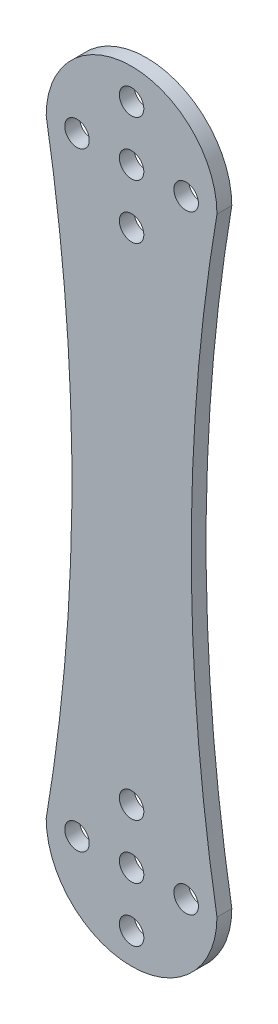
ISO-10303-21;
HEADER;
FILE_DESCRIPTION(('STEP AP214'),'2;1');
FILE_NAME('part.step','',(''),(''),'','','');
FILE_SCHEMA(('AUTOMOTIVE_DESIGN { 1 0 10303 214 1 1 1 1 }'));
ENDSEC;
DATA;
#1=APPLICATION_CONTEXT('core data for automotive mechanical design processes');
#2=APPLICATION_PROTOCOL_DEFINITION('international standard','automotive_design',2000,#1);
#3=PRODUCT_CONTEXT('',#1,'mechanical');
#4=PRODUCT('Part','Part','',(#3));
#5=PRODUCT_RELATED_PRODUCT_CATEGORY('part','',(#4));
#6=PRODUCT_DEFINITION_FORMATION('','',#4);
#7=PRODUCT_DEFINITION_CONTEXT('part definition',#1,'design');
#8=PRODUCT_DEFINITION('design','',#6,#7);
#9=PRODUCT_DEFINITION_SHAPE('','',#8);
#10=(LENGTH_UNIT() NAMED_UNIT(*) SI_UNIT(.MILLI.,.METRE.));
#11=(NAMED_UNIT(*) PLANE_ANGLE_UNIT() SI_UNIT($,.RADIAN.));
#12=(NAMED_UNIT(*) SI_UNIT($,.STERADIAN.) SOLID_ANGLE_UNIT());
#13=UNCERTAINTY_MEASURE_WITH_UNIT(LENGTH_MEASURE(1.E-05),#10,'distance_accuracy_value','');
#14=(GEOMETRIC_REPRESENTATION_CONTEXT(3) GLOBAL_UNCERTAINTY_ASSIGNED_CONTEXT((#13)) GLOBAL_UNIT_ASSIGNED_CONTEXT((#10,
#11,#12)) REPRESENTATION_CONTEXT('',''));
#15=CARTESIAN_POINT('',(0.,0.,0.));
#16=DIRECTION('',(0.,0.,1.));
#17=DIRECTION('',(1.,0.,0.));
#18=AXIS2_PLACEMENT_3D('',#15,#16,#17);
#19=CARTESIAN_POINT('',(305.86953285522,-29.3815576891017,2.));
#20=DIRECTION('',(0.,0.,-1.));
#21=DIRECTION('',(-1.,0.,0.));
#22=AXIS2_PLACEMENT_3D('',#19,#20,#21);
#23=CYLINDRICAL_SURFACE('',#22,244.402453237297);
#24=CARTESIAN_POINT('',(305.86953285522,-29.3815576891017,0.));
#25=DIRECTION('',(0.,0.,1.));
#26=DIRECTION('',(1.,0.,0.));
#27=AXIS2_PLACEMENT_3D('',#24,#25,#26);
#28=CIRCLE('',#27,244.402453237297);
#29=CARTESIAN_POINT('',(64.9306212024747,11.6184423108982,0.));
#30=VERTEX_POINT('',#29);
#31=CARTESIAN_POINT('',(64.9306212024748,-70.3815576891018,0.));
#32=VERTEX_POINT('',#31);
#33=EDGE_CURVE('E128',#30,#32,#28,.T.);
#34=ORIENTED_EDGE('',*,*,#33,.F.);
#35=DIRECTION('',(0.,0.,-1.));
#36=VECTOR('',#35,1.);
#37=CARTESIAN_POINT('',(64.9306212024747,11.6184423108982,2.));
#38=LINE('',#37,#36);
#39=CARTESIAN_POINT('',(64.9306212024747,11.6184423108982,2.));
#40=VERTEX_POINT('',#39);
#41=EDGE_CURVE('E11',#40,#30,#38,.T.);
#42=ORIENTED_EDGE('',*,*,#41,.F.);
#43=CARTESIAN_POINT('',(305.86953285522,-29.3815576891017,2.));
#44=DIRECTION('',(0.,0.,1.));
#45=DIRECTION('',(1.,0.,0.));
#46=AXIS2_PLACEMENT_3D('',#43,#44,#45);
#47=CIRCLE('',#46,244.402453237297);
#48=CARTESIAN_POINT('',(64.9306212024748,-70.3815576891018,2.));
#49=VERTEX_POINT('',#48);
#50=EDGE_CURVE('E83',#40,#49,#47,.T.);
#51=ORIENTED_EDGE('',*,*,#50,.T.);
#52=DIRECTION('',(0.,0.,-1.));
#53=VECTOR('',#52,1.);
#54=CARTESIAN_POINT('',(64.9306212024748,-70.3815576891018,2.));
#55=LINE('',#54,#53);
#56=EDGE_CURVE('E50',#49,#32,#55,.T.);
#57=ORIENTED_EDGE('',*,*,#56,.T.);
#58=EDGE_LOOP('',(#34,#42,#51,#57));
#59=FACE_BOUND('',#58,.T.);
#60=ADVANCED_FACE('F34',(#59),#23,.F.);
#61=CARTESIAN_POINT('',(53.4306212024747,11.6184423108982,2.));
#62=DIRECTION('',(0.,0.,-1.));
#63=DIRECTION('',(-1.,0.,0.));
#64=AXIS2_PLACEMENT_3D('',#61,#62,#63);
#65=CYLINDRICAL_SURFACE('',#64,11.5);
#66=CARTESIAN_POINT('',(53.4306212024747,11.6184423108982,0.));
#67=DIRECTION('',(0.,0.,1.));
#68=DIRECTION('',(1.,0.,0.));
#69=AXIS2_PLACEMENT_3D('',#66,#67,#68);
#70=CIRCLE('',#69,11.5);
#71=CARTESIAN_POINT('',(41.9306212024747,11.6184423108982,0.));
#72=VERTEX_POINT('',#71);
#73=EDGE_CURVE('E89',#30,#72,#70,.T.);
#74=ORIENTED_EDGE('',*,*,#73,.T.);
#75=DIRECTION('',(0.,0.,-1.));
#76=VECTOR('',#75,1.);
#77=CARTESIAN_POINT('',(41.9306212024747,11.6184423108982,2.));
#78=LINE('',#77,#76);
#79=CARTESIAN_POINT('',(41.9306212024747,11.6184423108982,2.));
#80=VERTEX_POINT('',#79);
#81=EDGE_CURVE('E42',#80,#72,#78,.T.);
#82=ORIENTED_EDGE('',*,*,#81,.F.);
#83=CARTESIAN_POINT('',(53.4306212024747,11.6184423108982,2.));
#84=DIRECTION('',(0.,0.,1.));
#85=DIRECTION('',(1.,0.,0.));
#86=AXIS2_PLACEMENT_3D('',#83,#84,#85);
#87=CIRCLE('',#86,11.5);
#88=EDGE_CURVE('E76',#40,#80,#87,.T.);
#89=ORIENTED_EDGE('',*,*,#88,.F.);
#90=ORIENTED_EDGE('',*,*,#41,.T.);
#91=EDGE_LOOP('',(#74,#82,#89,#90));
#92=FACE_BOUND('',#91,.T.);
#93=ADVANCED_FACE('F87',(#92),#65,.T.);
#94=CARTESIAN_POINT('',(-199.00829045027,-29.3815576891018,2.));
#95=DIRECTION('',(0.,0.,-1.));
#96=DIRECTION('',(-1.,0.,0.));
#97=AXIS2_PLACEMENT_3D('',#94,#95,#96);
#98=CYLINDRICAL_SURFACE('',#97,244.402453237297);
#99=CARTESIAN_POINT('',(-199.00829045027,-29.3815576891018,0.));
#100=DIRECTION('',(0.,0.,1.));
#101=DIRECTION('',(1.,0.,0.));
#102=AXIS2_PLACEMENT_3D('',#99,#100,#101);
#103=CIRCLE('',#102,244.402453237297);
#104=CARTESIAN_POINT('',(41.9306212024748,-70.3815576891018,0.));
#105=VERTEX_POINT('',#104);
#106=EDGE_CURVE('E131',#72,#105,#103,.F.);
#107=ORIENTED_EDGE('',*,*,#106,.T.);
#108=DIRECTION('',(0.,0.,-1.));
#109=VECTOR('',#108,1.);
#110=CARTESIAN_POINT('',(41.9306212024748,-70.3815576891018,2.));
#111=LINE('',#110,#109);
#112=CARTESIAN_POINT('',(41.9306212024748,-70.3815576891018,2.));
#113=VERTEX_POINT('',#112);
#114=EDGE_CURVE('E64',#113,#105,#111,.T.);
#115=ORIENTED_EDGE('',*,*,#114,.F.);
#116=CARTESIAN_POINT('',(-199.00829045027,-29.3815576891018,2.));
#117=DIRECTION('',(0.,0.,1.));
#118=DIRECTION('',(1.,0.,0.));
#119=AXIS2_PLACEMENT_3D('',#116,#117,#118);
#120=CIRCLE('',#119,244.402453237297);
#121=EDGE_CURVE('E82',#80,#113,#120,.F.);
#122=ORIENTED_EDGE('',*,*,#121,.F.);
#123=ORIENTED_EDGE('',*,*,#81,.T.);
#124=EDGE_LOOP('',(#107,#115,#122,#123));
#125=FACE_BOUND('',#124,.T.);
#126=ADVANCED_FACE('F92',(#125),#98,.F.);
#127=CARTESIAN_POINT('',(60.7806212024748,-70.3815576891018,2.));
#128=DIRECTION('',(0.,0.,-1.));
#129=DIRECTION('',(-1.,0.,0.));
#130=AXIS2_PLACEMENT_3D('',#127,#128,#129);
#131=CYLINDRICAL_SURFACE('',#130,1.65);
#132=CARTESIAN_POINT('',(60.7806212024748,-70.3815576891018,2.));
#133=DIRECTION('',(0.,0.,1.));
#134=DIRECTION('',(1.,0.,0.));
#135=AXIS2_PLACEMENT_3D('',#132,#133,#134);
#136=CIRCLE('',#135,1.65);
#137=CARTESIAN_POINT('',(62.4306212024748,-70.3815576891018,2.));
#138=VERTEX_POINT('',#137);
#139=EDGE_CURVE('E122',#138,#138,#136,.T.);
#140=ORIENTED_EDGE('',*,*,#139,.T.);
#141=EDGE_LOOP('',(#140));
#142=FACE_BOUND('',#141,.T.);
#143=CARTESIAN_POINT('',(60.7806212024748,-70.3815576891018,0.));
#144=DIRECTION('',(0.,0.,1.));
#145=DIRECTION('',(1.,0.,0.));
#146=AXIS2_PLACEMENT_3D('',#143,#144,#145);
#147=CIRCLE('',#146,1.65);
#148=CARTESIAN_POINT('',(62.4306212024748,-70.3815576891018,0.));
#149=VERTEX_POINT('',#148);
#150=EDGE_CURVE('E160',#149,#149,#147,.T.);
#151=ORIENTED_EDGE('',*,*,#150,.F.);
#152=EDGE_LOOP('',(#151));
#153=FACE_BOUND('',#152,.T.);
#154=ADVANCED_FACE('F191',(#142,#153),#131,.F.);
#155=CARTESIAN_POINT('',(53.4306212024748,-63.0315576891018,2.));
#156=DIRECTION('',(0.,0.,-1.));
#157=DIRECTION('',(-1.,0.,0.));
#158=AXIS2_PLACEMENT_3D('',#155,#156,#157);
#159=CYLINDRICAL_SURFACE('',#158,1.65);
#160=CARTESIAN_POINT('',(53.4306212024748,-63.0315576891018,2.));
#161=DIRECTION('',(0.,0.,1.));
#162=DIRECTION('',(1.,0.,0.));
#163=AXIS2_PLACEMENT_3D('',#160,#161,#162);
#164=CIRCLE('',#163,1.65);
#165=CARTESIAN_POINT('',(55.0806212024748,-63.0315576891018,2.));
#166=VERTEX_POINT('',#165);
#167=EDGE_CURVE('E119',#166,#166,#164,.T.);
#168=ORIENTED_EDGE('',*,*,#167,.T.);
#169=EDGE_LOOP('',(#168));
#170=FACE_BOUND('',#169,.T.);
#171=CARTESIAN_POINT('',(53.4306212024748,-63.0315576891018,0.));
#172=DIRECTION('',(0.,0.,1.));
#173=DIRECTION('',(1.,0.,0.));
#174=AXIS2_PLACEMENT_3D('',#171,#172,#173);
#175=CIRCLE('',#174,1.65);
#176=CARTESIAN_POINT('',(55.0806212024748,-63.0315576891018,0.));
#177=VERTEX_POINT('',#176);
#178=EDGE_CURVE('E157',#177,#177,#175,.T.);
#179=ORIENTED_EDGE('',*,*,#178,.F.);
#180=EDGE_LOOP('',(#179));
#181=FACE_BOUND('',#180,.T.);
#182=ADVANCED_FACE('F195',(#170,#181),#159,.F.);
#183=CARTESIAN_POINT('',(53.4306212024748,-70.3815576891018,2.));
#184=DIRECTION('',(0.,0.,-1.));
#185=DIRECTION('',(-1.,0.,0.));
#186=AXIS2_PLACEMENT_3D('',#183,#184,#185);
#187=CYLINDRICAL_SURFACE('',#186,1.65);
#188=CARTESIAN_POINT('',(53.4306212024748,-70.3815576891018,2.));
#189=DIRECTION('',(0.,0.,1.));
#190=DIRECTION('',(1.,0.,0.));
#191=AXIS2_PLACEMENT_3D('',#188,#189,#190);
#192=CIRCLE('',#191,1.65);
#193=CARTESIAN_POINT('',(55.0806212024748,-70.3815576891018,2.));
#194=VERTEX_POINT('',#193);
#195=EDGE_CURVE('E116',#194,#194,#192,.F.);
#196=ORIENTED_EDGE('',*,*,#195,.F.);
#197=EDGE_LOOP('',(#196));
#198=FACE_BOUND('',#197,.T.);
#199=CARTESIAN_POINT('',(53.4306212024748,-70.3815576891018,0.));
#200=DIRECTION('',(0.,0.,1.));
#201=DIRECTION('',(1.,0.,0.));
#202=AXIS2_PLACEMENT_3D('',#199,#200,#201);
#203=CIRCLE('',#202,1.65);
#204=CARTESIAN_POINT('',(55.0806212024748,-70.3815576891018,0.));
#205=VERTEX_POINT('',#204);
#206=EDGE_CURVE('E154',#205,#205,#203,.F.);
#207=ORIENTED_EDGE('',*,*,#206,.T.);
#208=EDGE_LOOP('',(#207));
#209=FACE_BOUND('',#208,.T.);
#210=ADVANCED_FACE('F201',(#198,#209),#187,.F.);
#211=CARTESIAN_POINT('',(60.7806212024747,11.6184423108982,2.));
#212=DIRECTION('',(0.,0.,-1.));
#213=DIRECTION('',(-1.,0.,0.));
#214=AXIS2_PLACEMENT_3D('',#211,#212,#213);
#215=CYLINDRICAL_SURFACE('',#214,1.65);
#216=CARTESIAN_POINT('',(60.7806212024747,11.6184423108982,2.));
#217=DIRECTION('',(0.,0.,1.));
#218=DIRECTION('',(1.,0.,0.));
#219=AXIS2_PLACEMENT_3D('',#216,#217,#218);
#220=CIRCLE('',#219,1.65);
#221=CARTESIAN_POINT('',(62.4306212024747,11.6184423108982,2.));
#222=VERTEX_POINT('',#221);
#223=EDGE_CURVE('E113',#222,#222,#220,.F.);
#224=ORIENTED_EDGE('',*,*,#223,.F.);
#225=EDGE_LOOP('',(#224));
#226=FACE_BOUND('',#225,.T.);
#227=CARTESIAN_POINT('',(60.7806212024747,11.6184423108982,0.));
#228=DIRECTION('',(0.,0.,1.));
#229=DIRECTION('',(1.,0.,0.));
#230=AXIS2_PLACEMENT_3D('',#227,#228,#229);
#231=CIRCLE('',#230,1.65);
#232=CARTESIAN_POINT('',(62.4306212024747,11.6184423108982,0.));
#233=VERTEX_POINT('',#232);
#234=EDGE_CURVE('E151',#233,#233,#231,.F.);
#235=ORIENTED_EDGE('',*,*,#234,.T.);
#236=EDGE_LOOP('',(#235));
#237=FACE_BOUND('',#236,.T.);
#238=ADVANCED_FACE('F209',(#226,#237),#215,.F.);
#239=CARTESIAN_POINT('',(53.4306212024748,18.9684423108982,2.));
#240=DIRECTION('',(0.,0.,-1.));
#241=DIRECTION('',(-1.,0.,0.));
#242=AXIS2_PLACEMENT_3D('',#239,#240,#241);
#243=CYLINDRICAL_SURFACE('',#242,1.64999999999999);
#244=CARTESIAN_POINT('',(53.4306212024748,18.9684423108982,2.));
#245=DIRECTION('',(0.,0.,1.));
#246=DIRECTION('',(1.,0.,0.));
#247=AXIS2_PLACEMENT_3D('',#244,#245,#246);
#248=CIRCLE('',#247,1.64999999999999);
#249=CARTESIAN_POINT('',(55.0806212024748,18.9684423108982,2.));
#250=VERTEX_POINT('',#249);
#251=EDGE_CURVE('E110',#250,#250,#248,.T.);
#252=ORIENTED_EDGE('',*,*,#251,.T.);
#253=EDGE_LOOP('',(#252));
#254=FACE_BOUND('',#253,.T.);
#255=CARTESIAN_POINT('',(53.4306212024748,18.9684423108982,0.));
#256=DIRECTION('',(0.,0.,1.));
#257=DIRECTION('',(1.,0.,0.));
#258=AXIS2_PLACEMENT_3D('',#255,#256,#257);
#259=CIRCLE('',#258,1.64999999999999);
#260=CARTESIAN_POINT('',(55.0806212024748,18.9684423108982,0.));
#261=VERTEX_POINT('',#260);
#262=EDGE_CURVE('E148',#261,#261,#259,.T.);
#263=ORIENTED_EDGE('',*,*,#262,.F.);
#264=EDGE_LOOP('',(#263));
#265=FACE_BOUND('',#264,.T.);
#266=ADVANCED_FACE('F213',(#254,#265),#243,.F.);
#267=CARTESIAN_POINT('',(46.0806212024747,11.6184423108982,2.));
#268=DIRECTION('',(0.,0.,-1.));
#269=DIRECTION('',(-1.,0.,0.));
#270=AXIS2_PLACEMENT_3D('',#267,#268,#269);
#271=CYLINDRICAL_SURFACE('',#270,1.65);
#272=CARTESIAN_POINT('',(46.0806212024747,11.6184423108982,2.));
#273=DIRECTION('',(0.,0.,1.));
#274=DIRECTION('',(1.,0.,0.));
#275=AXIS2_PLACEMENT_3D('',#272,#273,#274);
#276=CIRCLE('',#275,1.65);
#277=CARTESIAN_POINT('',(47.7306212024747,11.6184423108982,2.));
#278=VERTEX_POINT('',#277);
#279=EDGE_CURVE('E107',#278,#278,#276,.T.);
#280=ORIENTED_EDGE('',*,*,#279,.T.);
#281=EDGE_LOOP('',(#280));
#282=FACE_BOUND('',#281,.T.);
#283=CARTESIAN_POINT('',(46.0806212024747,11.6184423108982,0.));
#284=DIRECTION('',(0.,0.,1.));
#285=DIRECTION('',(1.,0.,0.));
#286=AXIS2_PLACEMENT_3D('',#283,#284,#285);
#287=CIRCLE('',#286,1.65);
#288=CARTESIAN_POINT('',(47.7306212024747,11.6184423108982,0.));
#289=VERTEX_POINT('',#288);
#290=EDGE_CURVE('E145',#289,#289,#287,.T.);
#291=ORIENTED_EDGE('',*,*,#290,.F.);
#292=EDGE_LOOP('',(#291));
#293=FACE_BOUND('',#292,.T.);
#294=ADVANCED_FACE('F217',(#282,#293),#271,.F.);
#295=CARTESIAN_POINT('',(53.4306212024747,11.6184423108982,2.));
#296=DIRECTION('',(0.,0.,-1.));
#297=DIRECTION('',(-1.,0.,0.));
#298=AXIS2_PLACEMENT_3D('',#295,#296,#297);
#299=CYLINDRICAL_SURFACE('',#298,1.65);
#300=CARTESIAN_POINT('',(53.4306212024747,11.6184423108982,2.));
#301=DIRECTION('',(0.,0.,1.));
#302=DIRECTION('',(1.,0.,0.));
#303=AXIS2_PLACEMENT_3D('',#300,#301,#302);
#304=CIRCLE('',#303,1.65);
#305=CARTESIAN_POINT('',(55.0806212024747,11.6184423108982,2.));
#306=VERTEX_POINT('',#305);
#307=EDGE_CURVE('E104',#306,#306,#304,.T.);
#308=ORIENTED_EDGE('',*,*,#307,.T.);
#309=EDGE_LOOP('',(#308));
#310=FACE_BOUND('',#309,.T.);
#311=CARTESIAN_POINT('',(53.4306212024747,11.6184423108982,0.));
#312=DIRECTION('',(0.,0.,1.));
#313=DIRECTION('',(1.,0.,0.));
#314=AXIS2_PLACEMENT_3D('',#311,#312,#313);
#315=CIRCLE('',#314,1.65);
#316=CARTESIAN_POINT('',(55.0806212024747,11.6184423108982,0.));
#317=VERTEX_POINT('',#316);
#318=EDGE_CURVE('E142',#317,#317,#315,.T.);
#319=ORIENTED_EDGE('',*,*,#318,.F.);
#320=EDGE_LOOP('',(#319));
#321=FACE_BOUND('',#320,.T.);
#322=ADVANCED_FACE('F221',(#310,#321),#299,.F.);
#323=CARTESIAN_POINT('',(53.4306212024747,4.26844231089819,2.));
#324=DIRECTION('',(0.,0.,-1.));
#325=DIRECTION('',(-1.,0.,0.));
#326=AXIS2_PLACEMENT_3D('',#323,#324,#325);
#327=CYLINDRICAL_SURFACE('',#326,1.65);
#328=CARTESIAN_POINT('',(53.4306212024747,4.26844231089819,2.));
#329=DIRECTION('',(0.,0.,1.));
#330=DIRECTION('',(1.,0.,0.));
#331=AXIS2_PLACEMENT_3D('',#328,#329,#330);
#332=CIRCLE('',#331,1.65);
#333=CARTESIAN_POINT('',(55.0806212024747,4.26844231089819,2.));
#334=VERTEX_POINT('',#333);
#335=EDGE_CURVE('E101',#334,#334,#332,.F.);
#336=ORIENTED_EDGE('',*,*,#335,.F.);
#337=EDGE_LOOP('',(#336));
#338=FACE_BOUND('',#337,.T.);
#339=CARTESIAN_POINT('',(53.4306212024747,4.26844231089819,0.));
#340=DIRECTION('',(0.,0.,1.));
#341=DIRECTION('',(1.,0.,0.));
#342=AXIS2_PLACEMENT_3D('',#339,#340,#341);
#343=CIRCLE('',#342,1.65);
#344=CARTESIAN_POINT('',(55.0806212024747,4.26844231089819,0.));
#345=VERTEX_POINT('',#344);
#346=EDGE_CURVE('E139',#345,#345,#343,.F.);
#347=ORIENTED_EDGE('',*,*,#346,.T.);
#348=EDGE_LOOP('',(#347));
#349=FACE_BOUND('',#348,.T.);
#350=ADVANCED_FACE('F180',(#338,#349),#327,.F.);
#351=CARTESIAN_POINT('',(46.0806212024747,-70.3815576891018,2.));
#352=DIRECTION('',(0.,0.,-1.));
#353=DIRECTION('',(-1.,0.,0.));
#354=AXIS2_PLACEMENT_3D('',#351,#352,#353);
#355=CYLINDRICAL_SURFACE('',#354,1.65);
#356=CARTESIAN_POINT('',(46.0806212024747,-70.3815576891018,2.));
#357=DIRECTION('',(0.,0.,1.));
#358=DIRECTION('',(1.,0.,0.));
#359=AXIS2_PLACEMENT_3D('',#356,#357,#358);
#360=CIRCLE('',#359,1.65);
#361=CARTESIAN_POINT('',(47.7306212024747,-70.3815576891018,2.));
#362=VERTEX_POINT('',#361);
#363=EDGE_CURVE('E95',#362,#362,#360,.F.);
#364=ORIENTED_EDGE('',*,*,#363,.F.);
#365=EDGE_LOOP('',(#364));
#366=FACE_BOUND('',#365,.T.);
#367=CARTESIAN_POINT('',(46.0806212024747,-70.3815576891018,0.));
#368=DIRECTION('',(0.,0.,1.));
#369=DIRECTION('',(1.,0.,0.));
#370=AXIS2_PLACEMENT_3D('',#367,#368,#369);
#371=CIRCLE('',#370,1.65);
#372=CARTESIAN_POINT('',(47.7306212024747,-70.3815576891018,0.));
#373=VERTEX_POINT('',#372);
#374=EDGE_CURVE('E136',#373,#373,#371,.F.);
#375=ORIENTED_EDGE('',*,*,#374,.T.);
#376=EDGE_LOOP('',(#375));
#377=FACE_BOUND('',#376,.T.);
#378=ADVANCED_FACE('F172',(#366,#377),#355,.F.);
#379=CARTESIAN_POINT('',(53.4306212024748,-70.3815576891018,2.));
#380=DIRECTION('',(0.,0.,-1.));
#381=DIRECTION('',(-1.,0.,0.));
#382=AXIS2_PLACEMENT_3D('',#379,#380,#381);
#383=CYLINDRICAL_SURFACE('',#382,11.5);
#384=CARTESIAN_POINT('',(53.4306212024748,-70.3815576891018,0.));
#385=DIRECTION('',(0.,0.,1.));
#386=DIRECTION('',(1.,0.,0.));
#387=AXIS2_PLACEMENT_3D('',#384,#385,#386);
#388=CIRCLE('',#387,11.5);
#389=EDGE_CURVE('E133',#32,#105,#388,.F.);
#390=ORIENTED_EDGE('',*,*,#389,.F.);
#391=ORIENTED_EDGE('',*,*,#56,.F.);
#392=CARTESIAN_POINT('',(53.4306212024748,-70.3815576891018,2.));
#393=DIRECTION('',(0.,0.,1.));
#394=DIRECTION('',(1.,0.,0.));
#395=AXIS2_PLACEMENT_3D('',#392,#393,#394);
#396=CIRCLE('',#395,11.5);
#397=EDGE_CURVE('E93',#49,#113,#396,.F.);
#398=ORIENTED_EDGE('',*,*,#397,.T.);
#399=ORIENTED_EDGE('',*,*,#114,.T.);
#400=EDGE_LOOP('',(#390,#391,#398,#399));
#401=FACE_BOUND('',#400,.T.);
#402=ADVANCED_FACE('F169',(#401),#383,.T.);
#403=CARTESIAN_POINT('',(53.4306212024748,-77.7315576891018,2.));
#404=DIRECTION('',(0.,0.,-1.));
#405=DIRECTION('',(-1.,0.,0.));
#406=AXIS2_PLACEMENT_3D('',#403,#404,#405);
#407=CYLINDRICAL_SURFACE('',#406,1.64999999999999);
#408=CARTESIAN_POINT('',(53.4306212024748,-77.7315576891018,2.));
#409=DIRECTION('',(0.,0.,1.));
#410=DIRECTION('',(1.,0.,0.));
#411=AXIS2_PLACEMENT_3D('',#408,#409,#410);
#412=CIRCLE('',#411,1.64999999999999);
#413=CARTESIAN_POINT('',(55.0806212024748,-77.7315576891018,2.));
#414=VERTEX_POINT('',#413);
#415=EDGE_CURVE('E125',#414,#414,#412,.F.);
#416=ORIENTED_EDGE('',*,*,#415,.F.);
#417=EDGE_LOOP('',(#416));
#418=FACE_BOUND('',#417,.T.);
#419=CARTESIAN_POINT('',(53.4306212024748,-77.7315576891018,0.));
#420=DIRECTION('',(0.,0.,1.));
#421=DIRECTION('',(1.,0.,0.));
#422=AXIS2_PLACEMENT_3D('',#419,#420,#421);
#423=CIRCLE('',#422,1.64999999999999);
#424=CARTESIAN_POINT('',(55.0806212024748,-77.7315576891018,0.));
#425=VERTEX_POINT('',#424);
#426=EDGE_CURVE('E163',#425,#425,#423,.F.);
#427=ORIENTED_EDGE('',*,*,#426,.T.);
#428=EDGE_LOOP('',(#427));
#429=FACE_BOUND('',#428,.T.);
#430=ADVANCED_FACE('F171',(#418,#429),#407,.F.);
#431=CARTESIAN_POINT('',(0.,0.,2.));
#432=DIRECTION('',(0.,0.,1.));
#433=DIRECTION('',(1.,0.,0.));
#434=AXIS2_PLACEMENT_3D('',#431,#432,#433);
#435=PLANE('',#434);
#436=ORIENTED_EDGE('',*,*,#50,.F.);
#437=ORIENTED_EDGE('',*,*,#88,.T.);
#438=ORIENTED_EDGE('',*,*,#121,.T.);
#439=ORIENTED_EDGE('',*,*,#397,.F.);
#440=EDGE_LOOP('',(#436,#437,#438,#439));
#441=FACE_BOUND('',#440,.T.);
#442=ORIENTED_EDGE('',*,*,#363,.T.);
#443=EDGE_LOOP('',(#442));
#444=FACE_BOUND('',#443,.T.);
#445=ORIENTED_EDGE('',*,*,#335,.T.);
#446=EDGE_LOOP('',(#445));
#447=FACE_BOUND('',#446,.T.);
#448=ORIENTED_EDGE('',*,*,#307,.F.);
#449=EDGE_LOOP('',(#448));
#450=FACE_BOUND('',#449,.T.);
#451=ORIENTED_EDGE('',*,*,#279,.F.);
#452=EDGE_LOOP('',(#451));
#453=FACE_BOUND('',#452,.T.);
#454=ORIENTED_EDGE('',*,*,#251,.F.);
#455=EDGE_LOOP('',(#454));
#456=FACE_BOUND('',#455,.T.);
#457=ORIENTED_EDGE('',*,*,#223,.T.);
#458=EDGE_LOOP('',(#457));
#459=FACE_BOUND('',#458,.T.);
#460=ORIENTED_EDGE('',*,*,#195,.T.);
#461=EDGE_LOOP('',(#460));
#462=FACE_BOUND('',#461,.T.);
#463=ORIENTED_EDGE('',*,*,#167,.F.);
#464=EDGE_LOOP('',(#463));
#465=FACE_BOUND('',#464,.T.);
#466=ORIENTED_EDGE('',*,*,#139,.F.);
#467=EDGE_LOOP('',(#466));
#468=FACE_BOUND('',#467,.T.);
#469=ORIENTED_EDGE('',*,*,#415,.T.);
#470=EDGE_LOOP('',(#469));
#471=FACE_BOUND('',#470,.T.);
#472=ADVANCED_FACE('F78',(#441,#444,#447,#450,#453,#456,#459,#462,#465,#468,#471),#435,.T.);
#473=CARTESIAN_POINT('',(0.,0.,0.));
#474=DIRECTION('',(0.,0.,1.));
#475=DIRECTION('',(1.,0.,0.));
#476=AXIS2_PLACEMENT_3D('',#473,#474,#475);
#477=PLANE('',#476);
#478=ORIENTED_EDGE('',*,*,#33,.T.);
#479=ORIENTED_EDGE('',*,*,#389,.T.);
#480=ORIENTED_EDGE('',*,*,#106,.F.);
#481=ORIENTED_EDGE('',*,*,#73,.F.);
#482=EDGE_LOOP('',(#478,#479,#480,#481));
#483=FACE_BOUND('',#482,.T.);
#484=ORIENTED_EDGE('',*,*,#374,.F.);
#485=EDGE_LOOP('',(#484));
#486=FACE_BOUND('',#485,.T.);
#487=ORIENTED_EDGE('',*,*,#346,.F.);
#488=EDGE_LOOP('',(#487));
#489=FACE_BOUND('',#488,.T.);
#490=ORIENTED_EDGE('',*,*,#318,.T.);
#491=EDGE_LOOP('',(#490));
#492=FACE_BOUND('',#491,.T.);
#493=ORIENTED_EDGE('',*,*,#290,.T.);
#494=EDGE_LOOP('',(#493));
#495=FACE_BOUND('',#494,.T.);
#496=ORIENTED_EDGE('',*,*,#262,.T.);
#497=EDGE_LOOP('',(#496));
#498=FACE_BOUND('',#497,.T.);
#499=ORIENTED_EDGE('',*,*,#234,.F.);
#500=EDGE_LOOP('',(#499));
#501=FACE_BOUND('',#500,.T.);
#502=ORIENTED_EDGE('',*,*,#206,.F.);
#503=EDGE_LOOP('',(#502));
#504=FACE_BOUND('',#503,.T.);
#505=ORIENTED_EDGE('',*,*,#178,.T.);
#506=EDGE_LOOP('',(#505));
#507=FACE_BOUND('',#506,.T.);
#508=ORIENTED_EDGE('',*,*,#150,.T.);
#509=EDGE_LOOP('',(#508));
#510=FACE_BOUND('',#509,.T.);
#511=ORIENTED_EDGE('',*,*,#426,.F.);
#512=EDGE_LOOP('',(#511));
#513=FACE_BOUND('',#512,.T.);
#514=ADVANCED_FACE('F234',(#483,#486,#489,#492,#495,#498,#501,#504,#507,#510,#513),#477,.F.);
#515=CLOSED_SHELL('',(#60,#93,#126,#154,#182,#210,#238,#266,#294,#322,#350,#378,#402,#430,#472,#514));
#516=MANIFOLD_SOLID_BREP('B2',#515);
#517=ADVANCED_BREP_SHAPE_REPRESENTATION('',(#18,#516),#14);
#518=SHAPE_DEFINITION_REPRESENTATION(#9,#517);
ENDSEC;
END-ISO-10303-21;
